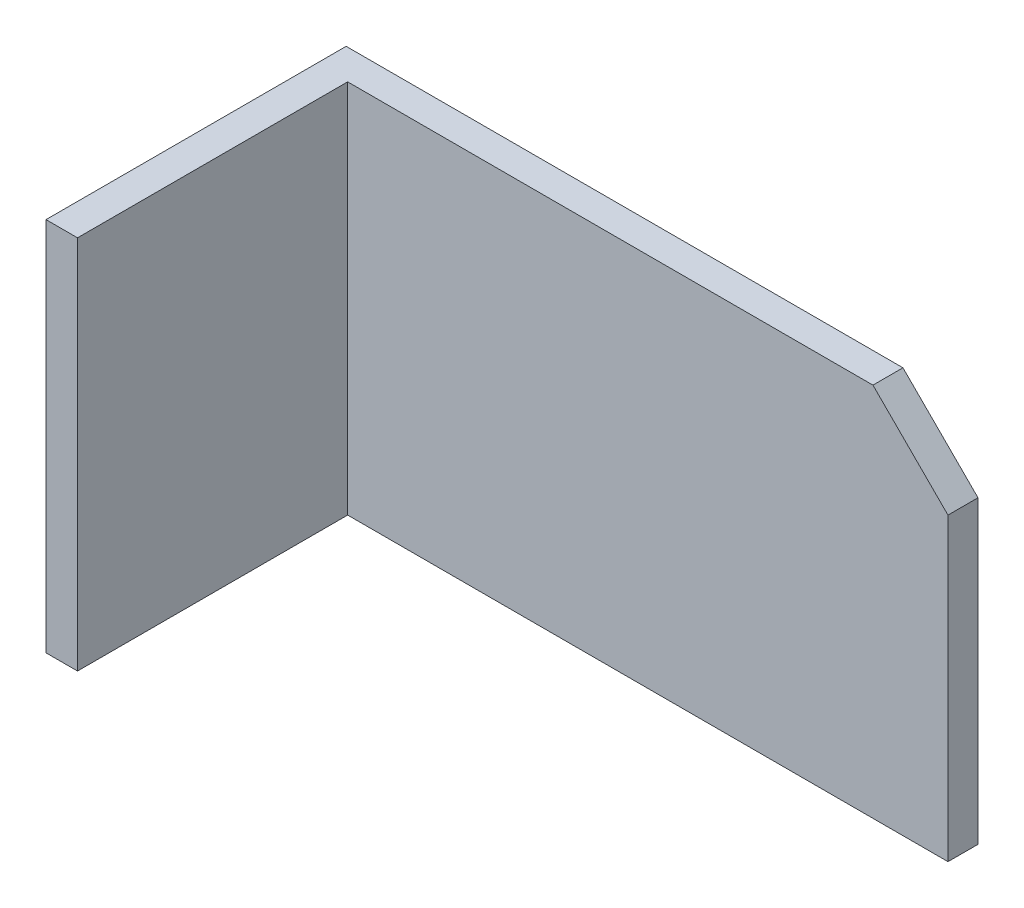
ISO-10303-21;
HEADER;
FILE_DESCRIPTION(('STEP AP214'),'2;1');
FILE_NAME('part.step','',(''),(''),'','','');
FILE_SCHEMA(('AUTOMOTIVE_DESIGN { 1 0 10303 214 1 1 1 1 }'));
ENDSEC;
DATA;
#1=APPLICATION_CONTEXT('core data for automotive mechanical design processes');
#2=APPLICATION_PROTOCOL_DEFINITION('international standard','automotive_design',2000,#1);
#3=PRODUCT_CONTEXT('',#1,'mechanical');
#4=PRODUCT('Part','Part','',(#3));
#5=PRODUCT_RELATED_PRODUCT_CATEGORY('part','',(#4));
#6=PRODUCT_DEFINITION_FORMATION('','',#4);
#7=PRODUCT_DEFINITION_CONTEXT('part definition',#1,'design');
#8=PRODUCT_DEFINITION('design','',#6,#7);
#9=PRODUCT_DEFINITION_SHAPE('','',#8);
#10=(LENGTH_UNIT() NAMED_UNIT(*) SI_UNIT(.MILLI.,.METRE.));
#11=(NAMED_UNIT(*) PLANE_ANGLE_UNIT() SI_UNIT($,.RADIAN.));
#12=(NAMED_UNIT(*) SI_UNIT($,.STERADIAN.) SOLID_ANGLE_UNIT());
#13=UNCERTAINTY_MEASURE_WITH_UNIT(LENGTH_MEASURE(1.E-05),#10,'distance_accuracy_value','');
#14=(GEOMETRIC_REPRESENTATION_CONTEXT(3) GLOBAL_UNCERTAINTY_ASSIGNED_CONTEXT((#13)) GLOBAL_UNIT_ASSIGNED_CONTEXT((#10,
#11,#12)) REPRESENTATION_CONTEXT('',''));
#15=CARTESIAN_POINT('',(0.,0.,0.));
#16=DIRECTION('',(0.,0.,1.));
#17=DIRECTION('',(1.,0.,0.));
#18=AXIS2_PLACEMENT_3D('',#15,#16,#17);
#19=CARTESIAN_POINT('',(-1.53882069959544,0.75,0.2));
#20=DIRECTION('',(0.,0.,1.));
#21=DIRECTION('',(1.,0.,0.));
#22=AXIS2_PLACEMENT_3D('',#19,#20,#21);
#23=PLANE('',#22);
#24=DIRECTION('',(1.,0.,0.));
#25=VECTOR('',#24,1.);
#26=CARTESIAN_POINT('',(-1.41898707437652,0.875,0.2));
#27=LINE('',#26,#25);
#28=CARTESIAN_POINT('',(-1.54932069959544,0.875,0.2));
#29=VERTEX_POINT('',#28);
#30=CARTESIAN_POINT('',(-1.52832069959544,0.875,0.2));
#31=VERTEX_POINT('',#30);
#32=EDGE_CURVE('E149',#29,#31,#27,.T.);
#33=ORIENTED_EDGE('',*,*,#32,.F.);
#34=DIRECTION('',(0.,-1.,0.));
#35=VECTOR('',#34,1.);
#36=CARTESIAN_POINT('',(-1.54932069959544,0.75,0.2));
#37=LINE('',#36,#35);
#38=CARTESIAN_POINT('',(-1.54932069959544,0.625,0.2));
#39=VERTEX_POINT('',#38);
#40=EDGE_CURVE('E143',#29,#39,#37,.T.);
#41=ORIENTED_EDGE('',*,*,#40,.T.);
#42=DIRECTION('',(1.,0.,0.));
#43=VECTOR('',#42,1.);
#44=CARTESIAN_POINT('',(-1.39679171408819,0.625,0.2));
#45=LINE('',#44,#43);
#46=CARTESIAN_POINT('',(-1.52832069959544,0.625,0.2));
#47=VERTEX_POINT('',#46);
#48=EDGE_CURVE('E183',#39,#47,#45,.T.);
#49=ORIENTED_EDGE('',*,*,#48,.T.);
#50=DIRECTION('',(0.,-1.,0.));
#51=VECTOR('',#50,1.);
#52=CARTESIAN_POINT('',(-1.52832069959544,0.75,0.2));
#53=LINE('',#52,#51);
#54=EDGE_CURVE('E11',#31,#47,#53,.T.);
#55=ORIENTED_EDGE('',*,*,#54,.F.);
#56=EDGE_LOOP('',(#33,#41,#49,#55));
#57=FACE_BOUND('',#56,.T.);
#58=ADVANCED_FACE('F16',(#57),#23,.T.);
#59=CARTESIAN_POINT('',(-1.52832069959544,0.75,0.11));
#60=DIRECTION('',(1.,0.,0.));
#61=DIRECTION('',(0.,0.,1.));
#62=AXIS2_PLACEMENT_3D('',#59,#60,#61);
#63=PLANE('',#62);
#64=DIRECTION('',(0.,0.,-1.));
#65=VECTOR('',#64,1.);
#66=CARTESIAN_POINT('',(-1.52832069959544,0.875,0.0448336252189144));
#67=LINE('',#66,#65);
#68=CARTESIAN_POINT('',(-1.52832069959544,0.875,0.02));
#69=VERTEX_POINT('',#68);
#70=EDGE_CURVE('E122',#31,#69,#67,.T.);
#71=ORIENTED_EDGE('',*,*,#70,.F.);
#72=ORIENTED_EDGE('',*,*,#54,.T.);
#73=DIRECTION('',(0.,0.,-1.));
#74=VECTOR('',#73,1.);
#75=CARTESIAN_POINT('',(-1.52832069959544,0.625,0.0420289855072467));
#76=LINE('',#75,#74);
#77=CARTESIAN_POINT('',(-1.52832069959544,0.625,0.02));
#78=VERTEX_POINT('',#77);
#79=EDGE_CURVE('E155',#47,#78,#76,.T.);
#80=ORIENTED_EDGE('',*,*,#79,.T.);
#81=DIRECTION('',(0.,-1.,0.));
#82=VECTOR('',#81,1.);
#83=CARTESIAN_POINT('',(-1.52832069959544,0.746711342510851,0.02));
#84=LINE('',#83,#82);
#85=EDGE_CURVE('E27',#69,#78,#84,.T.);
#86=ORIENTED_EDGE('',*,*,#85,.F.);
#87=EDGE_LOOP('',(#71,#72,#80,#86));
#88=FACE_BOUND('',#87,.T.);
#89=ADVANCED_FACE('F195',(#88),#63,.T.);
#90=CARTESIAN_POINT('',(-1.33333807407652,0.746711342510851,0.02));
#91=DIRECTION('',(0.,0.,1.));
#92=DIRECTION('',(1.,0.,0.));
#93=AXIS2_PLACEMENT_3D('',#90,#91,#92);
#94=PLANE('',#93);
#95=DIRECTION('',(0.707106781186546,-0.707106781186549,0.));
#96=VECTOR('',#95,1.);
#97=CARTESIAN_POINT('',(-1.15332069959544,0.85,0.02));
#98=LINE('',#97,#96);
#99=CARTESIAN_POINT('',(-1.17832069959543,0.875,0.02));
#100=VERTEX_POINT('',#99);
#101=CARTESIAN_POINT('',(-1.12832069959544,0.825,0.02));
#102=VERTEX_POINT('',#101);
#103=EDGE_CURVE('E124',#100,#102,#98,.T.);
#104=ORIENTED_EDGE('',*,*,#103,.F.);
#105=DIRECTION('',(1.,0.,0.));
#106=VECTOR('',#105,1.);
#107=CARTESIAN_POINT('',(-1.41898707437652,0.875,0.02));
#108=LINE('',#107,#106);
#109=EDGE_CURVE('E114',#69,#100,#108,.T.);
#110=ORIENTED_EDGE('',*,*,#109,.F.);
#111=ORIENTED_EDGE('',*,*,#85,.T.);
#112=DIRECTION('',(1.,0.,0.));
#113=VECTOR('',#112,1.);
#114=CARTESIAN_POINT('',(-1.39679171408819,0.625,0.02));
#115=LINE('',#114,#113);
#116=CARTESIAN_POINT('',(-1.12832069959544,0.625,0.02));
#117=VERTEX_POINT('',#116);
#118=EDGE_CURVE('E106',#78,#117,#115,.T.);
#119=ORIENTED_EDGE('',*,*,#118,.T.);
#120=DIRECTION('',(0.,-1.,0.));
#121=VECTOR('',#120,1.);
#122=CARTESIAN_POINT('',(-1.12832069959544,0.725,0.02));
#123=LINE('',#122,#121);
#124=EDGE_CURVE('E126',#102,#117,#123,.T.);
#125=ORIENTED_EDGE('',*,*,#124,.F.);
#126=EDGE_LOOP('',(#104,#110,#111,#119,#125));
#127=FACE_BOUND('',#126,.T.);
#128=ADVANCED_FACE('F125',(#127),#94,.T.);
#129=CARTESIAN_POINT('',(-1.41898707437652,0.875,0.0448336252189144));
#130=DIRECTION('',(0.,1.,0.));
#131=DIRECTION('',(1.,0.,0.));
#132=AXIS2_PLACEMENT_3D('',#129,#130,#131);
#133=PLANE('',#132);
#134=DIRECTION('',(0.,0.,1.));
#135=VECTOR('',#134,1.);
#136=CARTESIAN_POINT('',(-1.54932069959544,0.875,0.1));
#137=LINE('',#136,#135);
#138=CARTESIAN_POINT('',(-1.54932069959544,0.875,0.));
#139=VERTEX_POINT('',#138);
#140=EDGE_CURVE('E146',#139,#29,#137,.T.);
#141=ORIENTED_EDGE('',*,*,#140,.T.);
#142=ORIENTED_EDGE('',*,*,#32,.T.);
#143=ORIENTED_EDGE('',*,*,#70,.T.);
#144=ORIENTED_EDGE('',*,*,#109,.T.);
#145=DIRECTION('',(0.,0.,1.));
#146=VECTOR('',#145,1.);
#147=CARTESIAN_POINT('',(-1.17832069959543,0.875,0.01));
#148=LINE('',#147,#146);
#149=CARTESIAN_POINT('',(-1.17832069959543,0.875,0.));
#150=VERTEX_POINT('',#149);
#151=EDGE_CURVE('E120',#150,#100,#148,.T.);
#152=ORIENTED_EDGE('',*,*,#151,.F.);
#153=DIRECTION('',(-1.,0.,0.));
#154=VECTOR('',#153,1.);
#155=CARTESIAN_POINT('',(-1.34391182083059,0.875,0.));
#156=LINE('',#155,#154);
#157=EDGE_CURVE('E158',#150,#139,#156,.T.);
#158=ORIENTED_EDGE('',*,*,#157,.T.);
#159=EDGE_LOOP('',(#141,#142,#143,#144,#152,#158));
#160=FACE_BOUND('',#159,.T.);
#161=ADVANCED_FACE('F117',(#160),#133,.T.);
#162=CARTESIAN_POINT('',(-1.54932069959544,0.75,0.1));
#163=DIRECTION('',(1.,0.,0.));
#164=DIRECTION('',(0.,-1.,0.));
#165=AXIS2_PLACEMENT_3D('',#162,#163,#164);
#166=PLANE('',#165);
#167=DIRECTION('',(0.,-1.,0.));
#168=VECTOR('',#167,1.);
#169=CARTESIAN_POINT('',(-1.54932069959544,0.746816562660916,0.));
#170=LINE('',#169,#168);
#171=CARTESIAN_POINT('',(-1.54932069959544,0.625,0.));
#172=VERTEX_POINT('',#171);
#173=EDGE_CURVE('E141',#139,#172,#170,.T.);
#174=ORIENTED_EDGE('',*,*,#173,.T.);
#175=DIRECTION('',(0.,0.,1.));
#176=VECTOR('',#175,1.);
#177=CARTESIAN_POINT('',(-1.54932069959544,0.625,0.0420289855072467));
#178=LINE('',#177,#176);
#179=EDGE_CURVE('E147',#172,#39,#178,.T.);
#180=ORIENTED_EDGE('',*,*,#179,.T.);
#181=ORIENTED_EDGE('',*,*,#40,.F.);
#182=ORIENTED_EDGE('',*,*,#140,.F.);
#183=EDGE_LOOP('',(#174,#180,#181,#182));
#184=FACE_BOUND('',#183,.T.);
#185=ADVANCED_FACE('F199',(#184),#166,.F.);
#186=CARTESIAN_POINT('',(-1.39679171408819,0.625,0.0420289855072467));
#187=DIRECTION('',(0.,1.,0.));
#188=DIRECTION('',(0.,0.,-1.));
#189=AXIS2_PLACEMENT_3D('',#186,#187,#188);
#190=PLANE('',#189);
#191=ORIENTED_EDGE('',*,*,#118,.F.);
#192=ORIENTED_EDGE('',*,*,#79,.F.);
#193=ORIENTED_EDGE('',*,*,#48,.F.);
#194=ORIENTED_EDGE('',*,*,#179,.F.);
#195=DIRECTION('',(1.,0.,0.));
#196=VECTOR('',#195,1.);
#197=CARTESIAN_POINT('',(-1.34391182083059,0.625,0.));
#198=LINE('',#197,#196);
#199=CARTESIAN_POINT('',(-1.12832069959544,0.625,0.));
#200=VERTEX_POINT('',#199);
#201=EDGE_CURVE('E165',#172,#200,#198,.T.);
#202=ORIENTED_EDGE('',*,*,#201,.T.);
#203=DIRECTION('',(0.,0.,-1.));
#204=VECTOR('',#203,1.);
#205=CARTESIAN_POINT('',(-1.12832069959544,0.625,0.01));
#206=LINE('',#205,#204);
#207=EDGE_CURVE('E84',#117,#200,#206,.T.);
#208=ORIENTED_EDGE('',*,*,#207,.F.);
#209=EDGE_LOOP('',(#191,#192,#193,#194,#202,#208));
#210=FACE_BOUND('',#209,.T.);
#211=ADVANCED_FACE('F18',(#210),#190,.F.);
#212=CARTESIAN_POINT('',(-1.12832069959544,0.725,0.01));
#213=DIRECTION('',(1.,0.,0.));
#214=DIRECTION('',(0.,0.,1.));
#215=AXIS2_PLACEMENT_3D('',#212,#213,#214);
#216=PLANE('',#215);
#217=ORIENTED_EDGE('',*,*,#207,.T.);
#218=DIRECTION('',(0.,1.,0.));
#219=VECTOR('',#218,1.);
#220=CARTESIAN_POINT('',(-1.12832069959544,0.746816562660916,0.));
#221=LINE('',#220,#219);
#222=CARTESIAN_POINT('',(-1.12832069959544,0.825,0.));
#223=VERTEX_POINT('',#222);
#224=EDGE_CURVE('E172',#200,#223,#221,.T.);
#225=ORIENTED_EDGE('',*,*,#224,.T.);
#226=DIRECTION('',(0.,0.,-1.));
#227=VECTOR('',#226,1.);
#228=CARTESIAN_POINT('',(-1.12832069959544,0.825,0.01));
#229=LINE('',#228,#227);
#230=EDGE_CURVE('E69',#102,#223,#229,.T.);
#231=ORIENTED_EDGE('',*,*,#230,.F.);
#232=ORIENTED_EDGE('',*,*,#124,.T.);
#233=EDGE_LOOP('',(#217,#225,#231,#232));
#234=FACE_BOUND('',#233,.T.);
#235=ADVANCED_FACE('F198',(#234),#216,.T.);
#236=CARTESIAN_POINT('',(-1.15332069959544,0.85,0.01));
#237=DIRECTION('',(0.707106781186549,0.707106781186546,0.));
#238=DIRECTION('',(0.,0.,-1.));
#239=AXIS2_PLACEMENT_3D('',#236,#237,#238);
#240=PLANE('',#239);
#241=ORIENTED_EDGE('',*,*,#230,.T.);
#242=DIRECTION('',(-0.707106781186543,0.707106781186552,0.));
#243=VECTOR('',#242,1.);
#244=CARTESIAN_POINT('',(-1.12832069959544,0.825,0.));
#245=LINE('',#244,#243);
#246=EDGE_CURVE('E20',#223,#150,#245,.T.);
#247=ORIENTED_EDGE('',*,*,#246,.T.);
#248=ORIENTED_EDGE('',*,*,#151,.T.);
#249=ORIENTED_EDGE('',*,*,#103,.T.);
#250=EDGE_LOOP('',(#241,#247,#248,#249));
#251=FACE_BOUND('',#250,.T.);
#252=ADVANCED_FACE('F129',(#251),#240,.T.);
#253=CARTESIAN_POINT('',(-1.34391182083059,0.746816562660916,0.));
#254=DIRECTION('',(0.,0.,1.));
#255=DIRECTION('',(1.,0.,0.));
#256=AXIS2_PLACEMENT_3D('',#253,#254,#255);
#257=PLANE('',#256);
#258=ORIENTED_EDGE('',*,*,#224,.F.);
#259=ORIENTED_EDGE('',*,*,#201,.F.);
#260=ORIENTED_EDGE('',*,*,#173,.F.);
#261=ORIENTED_EDGE('',*,*,#157,.F.);
#262=ORIENTED_EDGE('',*,*,#246,.F.);
#263=EDGE_LOOP('',(#258,#259,#260,#261,#262));
#264=FACE_BOUND('',#263,.T.);
#265=ADVANCED_FACE('F217',(#264),#257,.F.);
#266=CLOSED_SHELL('',(#58,#89,#128,#161,#185,#211,#235,#252,#265));
#267=MANIFOLD_SOLID_BREP('B1',#266);
#268=ADVANCED_BREP_SHAPE_REPRESENTATION('',(#18,#267),#14);
#269=SHAPE_DEFINITION_REPRESENTATION(#9,#268);
ENDSEC;
END-ISO-10303-21;
